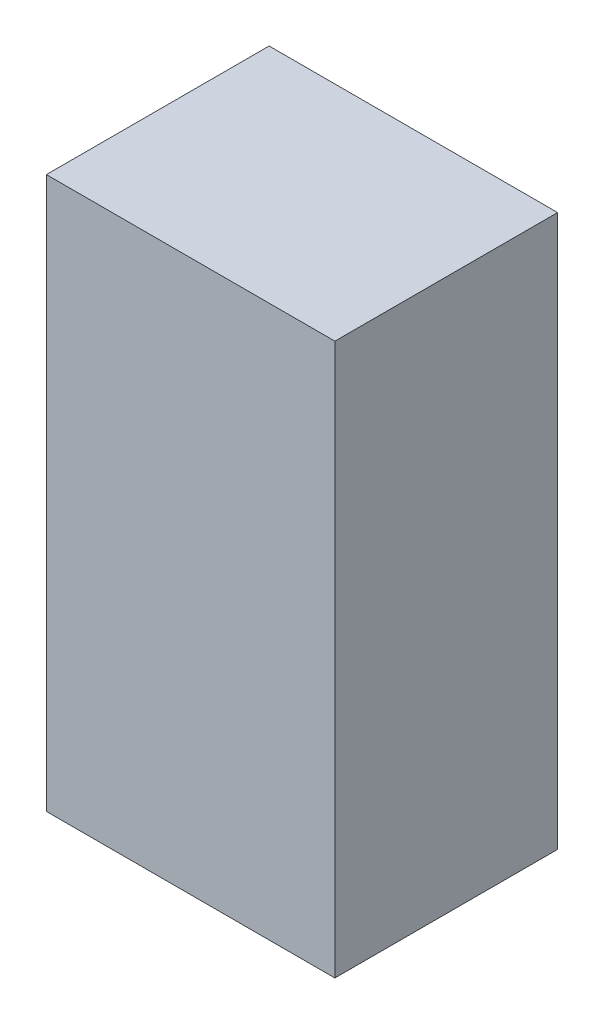
ISO-10303-21;
HEADER;
FILE_DESCRIPTION(('STEP AP214'),'2;1');
FILE_NAME('part.step','',(''),(''),'','','');
FILE_SCHEMA(('AUTOMOTIVE_DESIGN { 1 0 10303 214 1 1 1 1 }'));
ENDSEC;
DATA;
#1=APPLICATION_CONTEXT('core data for automotive mechanical design processes');
#2=APPLICATION_PROTOCOL_DEFINITION('international standard','automotive_design',2000,#1);
#3=PRODUCT_CONTEXT('',#1,'mechanical');
#4=PRODUCT('Part','Part','',(#3));
#5=PRODUCT_RELATED_PRODUCT_CATEGORY('part','',(#4));
#6=PRODUCT_DEFINITION_FORMATION('','',#4);
#7=PRODUCT_DEFINITION_CONTEXT('part definition',#1,'design');
#8=PRODUCT_DEFINITION('design','',#6,#7);
#9=PRODUCT_DEFINITION_SHAPE('','',#8);
#10=(LENGTH_UNIT() NAMED_UNIT(*) SI_UNIT(.MILLI.,.METRE.));
#11=(NAMED_UNIT(*) PLANE_ANGLE_UNIT() SI_UNIT($,.RADIAN.));
#12=(NAMED_UNIT(*) SI_UNIT($,.STERADIAN.) SOLID_ANGLE_UNIT());
#13=UNCERTAINTY_MEASURE_WITH_UNIT(LENGTH_MEASURE(1.E-05),#10,'distance_accuracy_value','');
#14=(GEOMETRIC_REPRESENTATION_CONTEXT(3) GLOBAL_UNCERTAINTY_ASSIGNED_CONTEXT((#13)) GLOBAL_UNIT_ASSIGNED_CONTEXT((#10,
#11,#12)) REPRESENTATION_CONTEXT('',''));
#15=CARTESIAN_POINT('',(0.,0.,0.));
#16=DIRECTION('',(0.,0.,1.));
#17=DIRECTION('',(1.,0.,0.));
#18=AXIS2_PLACEMENT_3D('',#15,#16,#17);
#19=CARTESIAN_POINT('',(0.16449294,0.31449264,0.));
#20=DIRECTION('',(0.,-1.,0.));
#21=DIRECTION('',(-1.,0.,0.));
#22=AXIS2_PLACEMENT_3D('',#19,#20,#21);
#23=PLANE('',#22);
#24=DIRECTION('',(-1.,0.,0.));
#25=VECTOR('',#24,1.);
#26=CARTESIAN_POINT('',(0.16449294,0.31449264,0.));
#27=LINE('',#26,#25);
#28=CARTESIAN_POINT('',(0.16449294,0.31449264,0.));
#29=VERTEX_POINT('',#28);
#30=CARTESIAN_POINT('',(-0.16449294,0.31449264,0.));
#31=VERTEX_POINT('',#30);
#32=EDGE_CURVE('E11',#29,#31,#27,.T.);
#33=ORIENTED_EDGE('',*,*,#32,.T.);
#34=DIRECTION('',(0.,0.,1.));
#35=VECTOR('',#34,1.);
#36=CARTESIAN_POINT('',(-0.16449294,0.31449264,0.));
#37=LINE('',#36,#35);
#38=CARTESIAN_POINT('',(-0.16449294,0.31449264,0.254));
#39=VERTEX_POINT('',#38);
#40=EDGE_CURVE('E24',#31,#39,#37,.T.);
#41=ORIENTED_EDGE('',*,*,#40,.T.);
#42=DIRECTION('',(-1.,0.,0.));
#43=VECTOR('',#42,1.);
#44=CARTESIAN_POINT('',(0.16449294,0.31449264,0.254));
#45=LINE('',#44,#43);
#46=CARTESIAN_POINT('',(0.16449294,0.31449264,0.254));
#47=VERTEX_POINT('',#46);
#48=EDGE_CURVE('E87',#47,#39,#45,.T.);
#49=ORIENTED_EDGE('',*,*,#48,.F.);
#50=DIRECTION('',(0.,0.,1.));
#51=VECTOR('',#50,1.);
#52=CARTESIAN_POINT('',(0.16449294,0.31449264,0.));
#53=LINE('',#52,#51);
#54=EDGE_CURVE('E36',#29,#47,#53,.T.);
#55=ORIENTED_EDGE('',*,*,#54,.F.);
#56=EDGE_LOOP('',(#33,#41,#49,#55));
#57=FACE_BOUND('',#56,.T.);
#58=ADVANCED_FACE('F17',(#57),#23,.F.);
#59=CARTESIAN_POINT('',(-0.16449294,0.31449264,0.));
#60=DIRECTION('',(1.,0.,0.));
#61=DIRECTION('',(0.,-1.,0.));
#62=AXIS2_PLACEMENT_3D('',#59,#60,#61);
#63=PLANE('',#62);
#64=DIRECTION('',(0.,-1.,0.));
#65=VECTOR('',#64,1.);
#66=CARTESIAN_POINT('',(-0.16449294,0.31449264,0.));
#67=LINE('',#66,#65);
#68=CARTESIAN_POINT('',(-0.16449294,-0.3144901,0.));
#69=VERTEX_POINT('',#68);
#70=EDGE_CURVE('E84',#31,#69,#67,.T.);
#71=ORIENTED_EDGE('',*,*,#70,.T.);
#72=DIRECTION('',(0.,0.,1.));
#73=VECTOR('',#72,1.);
#74=CARTESIAN_POINT('',(-0.16449294,-0.3144901,0.));
#75=LINE('',#74,#73);
#76=CARTESIAN_POINT('',(-0.16449294,-0.3144901,0.254));
#77=VERTEX_POINT('',#76);
#78=EDGE_CURVE('E82',#69,#77,#75,.T.);
#79=ORIENTED_EDGE('',*,*,#78,.T.);
#80=DIRECTION('',(0.,-1.,0.));
#81=VECTOR('',#80,1.);
#82=CARTESIAN_POINT('',(-0.16449294,0.31449264,0.254));
#83=LINE('',#82,#81);
#84=EDGE_CURVE('E62',#39,#77,#83,.T.);
#85=ORIENTED_EDGE('',*,*,#84,.F.);
#86=ORIENTED_EDGE('',*,*,#40,.F.);
#87=EDGE_LOOP('',(#71,#79,#85,#86));
#88=FACE_BOUND('',#87,.T.);
#89=ADVANCED_FACE('F89',(#88),#63,.F.);
#90=CARTESIAN_POINT('',(-0.16449294,-0.3144901,0.));
#91=DIRECTION('',(0.,1.,0.));
#92=DIRECTION('',(1.,0.,0.));
#93=AXIS2_PLACEMENT_3D('',#90,#91,#92);
#94=PLANE('',#93);
#95=DIRECTION('',(1.,0.,0.));
#96=VECTOR('',#95,1.);
#97=CARTESIAN_POINT('',(-0.16449294,-0.3144901,0.));
#98=LINE('',#97,#96);
#99=CARTESIAN_POINT('',(0.16449294,-0.3144901,0.));
#100=VERTEX_POINT('',#99);
#101=EDGE_CURVE('E71',#69,#100,#98,.T.);
#102=ORIENTED_EDGE('',*,*,#101,.T.);
#103=DIRECTION('',(0.,0.,1.));
#104=VECTOR('',#103,1.);
#105=CARTESIAN_POINT('',(0.16449294,-0.3144901,0.));
#106=LINE('',#105,#104);
#107=CARTESIAN_POINT('',(0.16449294,-0.3144901,0.254));
#108=VERTEX_POINT('',#107);
#109=EDGE_CURVE('E65',#100,#108,#106,.T.);
#110=ORIENTED_EDGE('',*,*,#109,.T.);
#111=DIRECTION('',(1.,0.,0.));
#112=VECTOR('',#111,1.);
#113=CARTESIAN_POINT('',(-0.16449294,-0.3144901,0.254));
#114=LINE('',#113,#112);
#115=EDGE_CURVE('E57',#77,#108,#114,.T.);
#116=ORIENTED_EDGE('',*,*,#115,.F.);
#117=ORIENTED_EDGE('',*,*,#78,.F.);
#118=EDGE_LOOP('',(#102,#110,#116,#117));
#119=FACE_BOUND('',#118,.T.);
#120=ADVANCED_FACE('F69',(#119),#94,.F.);
#121=CARTESIAN_POINT('',(0.16449294,-0.3144901,0.));
#122=DIRECTION('',(-1.,0.,0.));
#123=DIRECTION('',(0.,1.,0.));
#124=AXIS2_PLACEMENT_3D('',#121,#122,#123);
#125=PLANE('',#124);
#126=DIRECTION('',(0.,1.,0.));
#127=VECTOR('',#126,1.);
#128=CARTESIAN_POINT('',(0.16449294,-0.3144901,0.));
#129=LINE('',#128,#127);
#130=EDGE_CURVE('E66',#100,#29,#129,.T.);
#131=ORIENTED_EDGE('',*,*,#130,.T.);
#132=ORIENTED_EDGE('',*,*,#54,.T.);
#133=DIRECTION('',(0.,1.,0.));
#134=VECTOR('',#133,1.);
#135=CARTESIAN_POINT('',(0.16449294,-0.3144901,0.254));
#136=LINE('',#135,#134);
#137=EDGE_CURVE('E61',#108,#47,#136,.T.);
#138=ORIENTED_EDGE('',*,*,#137,.F.);
#139=ORIENTED_EDGE('',*,*,#109,.F.);
#140=EDGE_LOOP('',(#131,#132,#138,#139));
#141=FACE_BOUND('',#140,.T.);
#142=ADVANCED_FACE('F76',(#141),#125,.F.);
#143=CARTESIAN_POINT('',(0.16449294,0.31449264,0.));
#144=DIRECTION('',(0.,0.,-1.));
#145=DIRECTION('',(-1.,0.,0.));
#146=AXIS2_PLACEMENT_3D('',#143,#144,#145);
#147=PLANE('',#146);
#148=ORIENTED_EDGE('',*,*,#130,.F.);
#149=ORIENTED_EDGE('',*,*,#101,.F.);
#150=ORIENTED_EDGE('',*,*,#70,.F.);
#151=ORIENTED_EDGE('',*,*,#32,.F.);
#152=EDGE_LOOP('',(#148,#149,#150,#151));
#153=FACE_BOUND('',#152,.T.);
#154=ADVANCED_FACE('F91',(#153),#147,.T.);
#155=CARTESIAN_POINT('',(0.16449294,0.31449264,0.254));
#156=DIRECTION('',(0.,0.,-1.));
#157=DIRECTION('',(-1.,0.,0.));
#158=AXIS2_PLACEMENT_3D('',#155,#156,#157);
#159=PLANE('',#158);
#160=ORIENTED_EDGE('',*,*,#48,.T.);
#161=ORIENTED_EDGE('',*,*,#84,.T.);
#162=ORIENTED_EDGE('',*,*,#115,.T.);
#163=ORIENTED_EDGE('',*,*,#137,.T.);
#164=EDGE_LOOP('',(#160,#161,#162,#163));
#165=FACE_BOUND('',#164,.T.);
#166=ADVANCED_FACE('F59',(#165),#159,.F.);
#167=CLOSED_SHELL('',(#58,#89,#120,#142,#154,#166));
#168=MANIFOLD_SOLID_BREP('B1',#167);
#169=ADVANCED_BREP_SHAPE_REPRESENTATION('',(#18,#168),#14);
#170=SHAPE_DEFINITION_REPRESENTATION(#9,#169);
ENDSEC;
END-ISO-10303-21;
